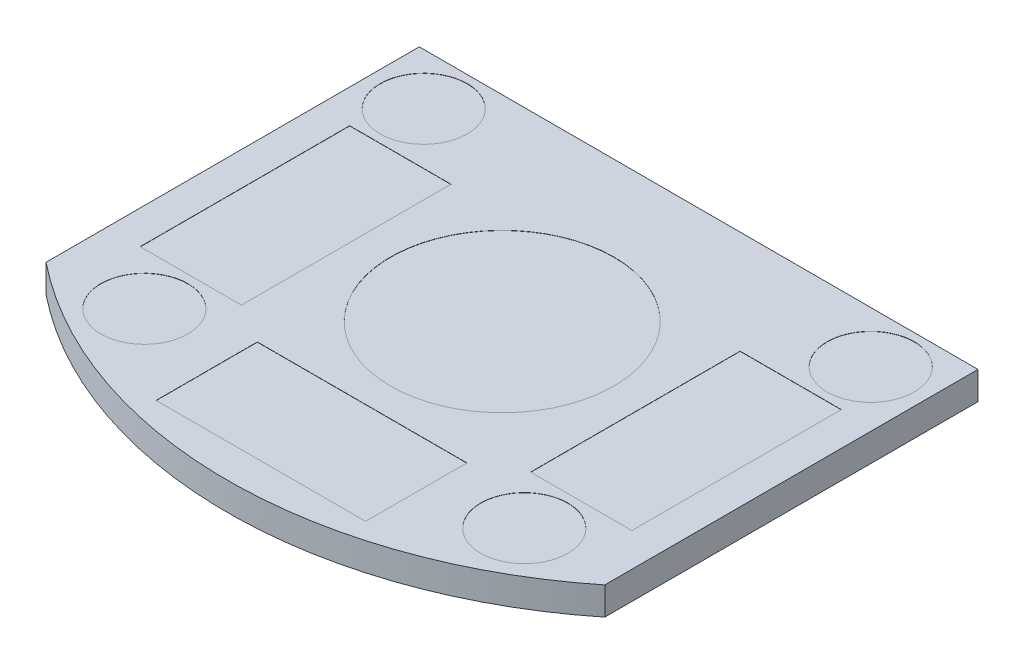
ISO-10303-21;
HEADER;
FILE_DESCRIPTION(('STEP AP214'),'2;1');
FILE_NAME('part.step','',(''),(''),'','','');
FILE_SCHEMA(('AUTOMOTIVE_DESIGN { 1 0 10303 214 1 1 1 1 }'));
ENDSEC;
DATA;
#1=APPLICATION_CONTEXT('core data for automotive mechanical design processes');
#2=APPLICATION_PROTOCOL_DEFINITION('international standard','automotive_design',2000,#1);
#3=PRODUCT_CONTEXT('',#1,'mechanical');
#4=PRODUCT('Part','Part','',(#3));
#5=PRODUCT_RELATED_PRODUCT_CATEGORY('part','',(#4));
#6=PRODUCT_DEFINITION_FORMATION('','',#4);
#7=PRODUCT_DEFINITION_CONTEXT('part definition',#1,'design');
#8=PRODUCT_DEFINITION('design','',#6,#7);
#9=PRODUCT_DEFINITION_SHAPE('','',#8);
#10=(LENGTH_UNIT() NAMED_UNIT(*) SI_UNIT(.MILLI.,.METRE.));
#11=(NAMED_UNIT(*) PLANE_ANGLE_UNIT() SI_UNIT($,.RADIAN.));
#12=(NAMED_UNIT(*) SI_UNIT($,.STERADIAN.) SOLID_ANGLE_UNIT());
#13=UNCERTAINTY_MEASURE_WITH_UNIT(LENGTH_MEASURE(1.E-05),#10,'distance_accuracy_value','');
#14=(GEOMETRIC_REPRESENTATION_CONTEXT(3) GLOBAL_UNCERTAINTY_ASSIGNED_CONTEXT((#13)) GLOBAL_UNIT_ASSIGNED_CONTEXT((#10,
#11,#12)) REPRESENTATION_CONTEXT('',''));
#15=CARTESIAN_POINT('',(0.,0.,0.));
#16=DIRECTION('',(0.,0.,1.));
#17=DIRECTION('',(1.,0.,0.));
#18=AXIS2_PLACEMENT_3D('',#15,#16,#17);
#19=CARTESIAN_POINT('',(-31.75,12.7,0.));
#20=DIRECTION('',(1.,0.,0.));
#21=DIRECTION('',(0.,0.,-1.));
#22=AXIS2_PLACEMENT_3D('',#19,#20,#21);
#23=PLANE('',#22);
#24=DIRECTION('',(0.,0.,1.));
#25=VECTOR('',#24,1.);
#26=CARTESIAN_POINT('',(-31.75,0.,0.));
#27=LINE('',#26,#25);
#28=CARTESIAN_POINT('',(-31.75,0.,0.));
#29=VERTEX_POINT('',#28);
#30=CARTESIAN_POINT('',(-31.75,0.,42.418));
#31=VERTEX_POINT('',#30);
#32=EDGE_CURVE('E163',#29,#31,#27,.T.);
#33=ORIENTED_EDGE('',*,*,#32,.F.);
#34=DIRECTION('',(0.,1.,0.));
#35=VECTOR('',#34,1.);
#36=CARTESIAN_POINT('',(-31.75,-3.175,0.));
#37=LINE('',#36,#35);
#38=CARTESIAN_POINT('',(-31.75,-3.175,0.));
#39=VERTEX_POINT('',#38);
#40=EDGE_CURVE('E53',#39,#29,#37,.T.);
#41=ORIENTED_EDGE('',*,*,#40,.F.);
#42=DIRECTION('',(0.,0.,-1.));
#43=VECTOR('',#42,1.);
#44=CARTESIAN_POINT('',(-31.75,-3.175,42.418));
#45=LINE('',#44,#43);
#46=CARTESIAN_POINT('',(-31.75,-3.175,42.418));
#47=VERTEX_POINT('',#46);
#48=EDGE_CURVE('E161',#47,#39,#45,.T.);
#49=ORIENTED_EDGE('',*,*,#48,.F.);
#50=DIRECTION('',(0.,-1.,0.));
#51=VECTOR('',#50,1.);
#52=CARTESIAN_POINT('',(-31.75,12.7,42.418));
#53=LINE('',#52,#51);
#54=EDGE_CURVE('E11',#31,#47,#53,.T.);
#55=ORIENTED_EDGE('',*,*,#54,.F.);
#56=EDGE_LOOP('',(#33,#41,#49,#55));
#57=FACE_BOUND('',#56,.T.);
#58=ADVANCED_FACE('F39',(#57),#23,.F.);
#59=CARTESIAN_POINT('',(0.,12.7,2.76226271017016));
#60=DIRECTION('',(0.,-1.,0.));
#61=DIRECTION('',(0.,0.,-1.));
#62=AXIS2_PLACEMENT_3D('',#59,#60,#61);
#63=CYLINDRICAL_SURFACE('',#62,50.8);
#64=CARTESIAN_POINT('',(0.,0.,2.76226271017016));
#65=DIRECTION('',(0.,1.,0.));
#66=DIRECTION('',(0.,0.,1.));
#67=AXIS2_PLACEMENT_3D('',#64,#65,#66);
#68=CIRCLE('',#67,50.8);
#69=CARTESIAN_POINT('',(31.75,0.,42.418));
#70=VERTEX_POINT('',#69);
#71=EDGE_CURVE('E183',#31,#70,#68,.T.);
#72=ORIENTED_EDGE('',*,*,#71,.F.);
#73=ORIENTED_EDGE('',*,*,#54,.T.);
#74=CARTESIAN_POINT('',(0.,-3.175,2.76226271017016));
#75=DIRECTION('',(0.,-1.,0.));
#76=DIRECTION('',(0.,0.,-1.));
#77=AXIS2_PLACEMENT_3D('',#74,#75,#76);
#78=CIRCLE('',#77,50.8);
#79=CARTESIAN_POINT('',(31.75,-3.175,42.418));
#80=VERTEX_POINT('',#79);
#81=EDGE_CURVE('E167',#80,#47,#78,.T.);
#82=ORIENTED_EDGE('',*,*,#81,.F.);
#83=DIRECTION('',(0.,-1.,0.));
#84=VECTOR('',#83,1.);
#85=CARTESIAN_POINT('',(31.75,12.7,42.418));
#86=LINE('',#85,#84);
#87=EDGE_CURVE('E46',#70,#80,#86,.T.);
#88=ORIENTED_EDGE('',*,*,#87,.F.);
#89=EDGE_LOOP('',(#72,#73,#82,#88));
#90=FACE_BOUND('',#89,.T.);
#91=ADVANCED_FACE('F182',(#90),#63,.T.);
#92=CARTESIAN_POINT('',(31.75,12.7,0.));
#93=DIRECTION('',(-1.,0.,0.));
#94=DIRECTION('',(0.,0.,1.));
#95=AXIS2_PLACEMENT_3D('',#92,#93,#94);
#96=PLANE('',#95);
#97=DIRECTION('',(0.,0.,1.));
#98=VECTOR('',#97,1.);
#99=CARTESIAN_POINT('',(31.75,-3.175,0.));
#100=LINE('',#99,#98);
#101=CARTESIAN_POINT('',(31.75,-3.175,0.));
#102=VERTEX_POINT('',#101);
#103=EDGE_CURVE('E168',#102,#80,#100,.T.);
#104=ORIENTED_EDGE('',*,*,#103,.F.);
#105=DIRECTION('',(0.,1.,0.));
#106=VECTOR('',#105,1.);
#107=CARTESIAN_POINT('',(31.75,-3.175,0.));
#108=LINE('',#107,#106);
#109=CARTESIAN_POINT('',(31.75,0.,0.));
#110=VERTEX_POINT('',#109);
#111=EDGE_CURVE('E151',#102,#110,#108,.T.);
#112=ORIENTED_EDGE('',*,*,#111,.T.);
#113=DIRECTION('',(0.,0.,-1.));
#114=VECTOR('',#113,1.);
#115=CARTESIAN_POINT('',(31.75,0.,0.));
#116=LINE('',#115,#114);
#117=EDGE_CURVE('E179',#70,#110,#116,.T.);
#118=ORIENTED_EDGE('',*,*,#117,.F.);
#119=ORIENTED_EDGE('',*,*,#87,.T.);
#120=EDGE_LOOP('',(#104,#112,#118,#119));
#121=FACE_BOUND('',#120,.T.);
#122=ADVANCED_FACE('F177',(#121),#96,.F.);
#123=CARTESIAN_POINT('',(0.,-3.175,2.76226271017016));
#124=DIRECTION('',(0.,-1.,0.));
#125=DIRECTION('',(0.,0.,-1.));
#126=AXIS2_PLACEMENT_3D('',#123,#124,#125);
#127=PLANE('',#126);
#128=DIRECTION('',(1.,0.,0.));
#129=VECTOR('',#128,1.);
#130=CARTESIAN_POINT('',(-31.75,-3.175,0.));
#131=LINE('',#130,#129);
#132=EDGE_CURVE('E148',#39,#102,#131,.T.);
#133=ORIENTED_EDGE('',*,*,#132,.T.);
#134=ORIENTED_EDGE('',*,*,#103,.T.);
#135=ORIENTED_EDGE('',*,*,#81,.T.);
#136=ORIENTED_EDGE('',*,*,#48,.T.);
#137=EDGE_LOOP('',(#133,#134,#135,#136));
#138=FACE_BOUND('',#137,.T.);
#139=ADVANCED_FACE('F165',(#138),#127,.T.);
#140=CARTESIAN_POINT('',(0.,0.,0.));
#141=DIRECTION('',(0.,1.,0.));
#142=DIRECTION('',(0.,0.,1.));
#143=AXIS2_PLACEMENT_3D('',#140,#141,#142);
#144=PLANE('',#143);
#145=DIRECTION('',(1.,0.,0.));
#146=VECTOR('',#145,1.);
#147=CARTESIAN_POINT('',(-31.75,0.,0.));
#148=LINE('',#147,#146);
#149=EDGE_CURVE('E155',#29,#110,#148,.T.);
#150=ORIENTED_EDGE('',*,*,#149,.F.);
#151=ORIENTED_EDGE('',*,*,#32,.T.);
#152=ORIENTED_EDGE('',*,*,#71,.T.);
#153=ORIENTED_EDGE('',*,*,#117,.T.);
#154=EDGE_LOOP('',(#150,#151,#152,#153));
#155=FACE_BOUND('',#154,.T.);
#156=DIRECTION('',(0.,0.,1.));
#157=VECTOR('',#156,1.);
#158=CARTESIAN_POINT('',(-27.94,0.,11.7157627101702));
#159=LINE('',#158,#157);
#160=CARTESIAN_POINT('',(-27.94,0.,11.7157627101702));
#161=VERTEX_POINT('',#160);
#162=CARTESIAN_POINT('',(-27.94,0.,35.5282627101702));
#163=VERTEX_POINT('',#162);
#164=EDGE_CURVE('E61',#161,#163,#159,.T.);
#165=ORIENTED_EDGE('',*,*,#164,.F.);
#166=DIRECTION('',(-1.,0.,0.));
#167=VECTOR('',#166,1.);
#168=CARTESIAN_POINT('',(-27.94,0.,11.7157627101702));
#169=LINE('',#168,#167);
#170=CARTESIAN_POINT('',(-16.430625,0.,11.7157627101702));
#171=VERTEX_POINT('',#170);
#172=EDGE_CURVE('E291',#171,#161,#169,.T.);
#173=ORIENTED_EDGE('',*,*,#172,.F.);
#174=DIRECTION('',(0.,0.,-1.));
#175=VECTOR('',#174,1.);
#176=CARTESIAN_POINT('',(-16.430625,0.,11.7157627101702));
#177=LINE('',#176,#175);
#178=CARTESIAN_POINT('',(-16.430625,0.,35.5282627101702));
#179=VERTEX_POINT('',#178);
#180=EDGE_CURVE('E295',#179,#171,#177,.T.);
#181=ORIENTED_EDGE('',*,*,#180,.F.);
#182=DIRECTION('',(1.,0.,0.));
#183=VECTOR('',#182,1.);
#184=CARTESIAN_POINT('',(-27.94,0.,35.5282627101702));
#185=LINE('',#184,#183);
#186=EDGE_CURVE('E298',#163,#179,#185,.T.);
#187=ORIENTED_EDGE('',*,*,#186,.F.);
#188=EDGE_LOOP('',(#165,#173,#181,#187));
#189=FACE_BOUND('',#188,.T.);
#190=DIRECTION('',(0.,0.,1.));
#191=VECTOR('',#190,1.);
#192=CARTESIAN_POINT('',(-11.90625,0.,38.2428877101702));
#193=LINE('',#192,#191);
#194=CARTESIAN_POINT('',(-11.90625,0.,38.2428877101702));
#195=VERTEX_POINT('',#194);
#196=CARTESIAN_POINT('',(-11.90625,0.,49.7522627101702));
#197=VERTEX_POINT('',#196);
#198=EDGE_CURVE('E266',#195,#197,#193,.T.);
#199=ORIENTED_EDGE('',*,*,#198,.F.);
#200=DIRECTION('',(-1.,0.,0.));
#201=VECTOR('',#200,1.);
#202=CARTESIAN_POINT('',(11.90625,0.,38.2428877101702));
#203=LINE('',#202,#201);
#204=CARTESIAN_POINT('',(11.90625,0.,38.2428877101702));
#205=VERTEX_POINT('',#204);
#206=EDGE_CURVE('E255',#205,#195,#203,.T.);
#207=ORIENTED_EDGE('',*,*,#206,.F.);
#208=DIRECTION('',(0.,0.,-1.));
#209=VECTOR('',#208,1.);
#210=CARTESIAN_POINT('',(11.90625,0.,38.2428877101702));
#211=LINE('',#210,#209);
#212=CARTESIAN_POINT('',(11.90625,0.,49.7522627101702));
#213=VERTEX_POINT('',#212);
#214=EDGE_CURVE('E271',#213,#205,#211,.T.);
#215=ORIENTED_EDGE('',*,*,#214,.F.);
#216=DIRECTION('',(1.,0.,0.));
#217=VECTOR('',#216,1.);
#218=CARTESIAN_POINT('',(11.90625,0.,49.7522627101702));
#219=LINE('',#218,#217);
#220=EDGE_CURVE('E268',#197,#213,#219,.T.);
#221=ORIENTED_EDGE('',*,*,#220,.F.);
#222=EDGE_LOOP('',(#199,#207,#215,#221));
#223=FACE_BOUND('',#222,.T.);
#224=DIRECTION('',(-1.,0.,0.));
#225=VECTOR('',#224,1.);
#226=CARTESIAN_POINT('',(27.94,0.,11.7157627101702));
#227=LINE('',#226,#225);
#228=CARTESIAN_POINT('',(27.94,0.,11.7157627101702));
#229=VERTEX_POINT('',#228);
#230=CARTESIAN_POINT('',(16.430625,0.,11.7157627101702));
#231=VERTEX_POINT('',#230);
#232=EDGE_CURVE('E233',#229,#231,#227,.T.);
#233=ORIENTED_EDGE('',*,*,#232,.F.);
#234=DIRECTION('',(0.,0.,-1.));
#235=VECTOR('',#234,1.);
#236=CARTESIAN_POINT('',(27.94,0.,11.7157627101702));
#237=LINE('',#236,#235);
#238=CARTESIAN_POINT('',(27.94,0.,35.5282627101702));
#239=VERTEX_POINT('',#238);
#240=EDGE_CURVE('E222',#239,#229,#237,.T.);
#241=ORIENTED_EDGE('',*,*,#240,.F.);
#242=DIRECTION('',(1.,0.,0.));
#243=VECTOR('',#242,1.);
#244=CARTESIAN_POINT('',(27.94,0.,35.5282627101702));
#245=LINE('',#244,#243);
#246=CARTESIAN_POINT('',(16.430625,0.,35.5282627101702));
#247=VERTEX_POINT('',#246);
#248=EDGE_CURVE('E239',#247,#239,#245,.T.);
#249=ORIENTED_EDGE('',*,*,#248,.F.);
#250=DIRECTION('',(0.,0.,1.));
#251=VECTOR('',#250,1.);
#252=CARTESIAN_POINT('',(16.430625,0.,11.7157627101702));
#253=LINE('',#252,#251);
#254=EDGE_CURVE('E236',#231,#247,#253,.T.);
#255=ORIENTED_EDGE('',*,*,#254,.F.);
#256=EDGE_LOOP('',(#233,#241,#249,#255));
#257=FACE_BOUND('',#256,.T.);
#258=CARTESIAN_POINT('',(-21.59,0.,41.402));
#259=DIRECTION('',(0.,1.,0.));
#260=DIRECTION('',(0.,0.,-1.));
#261=AXIS2_PLACEMENT_3D('',#258,#259,#260);
#262=CIRCLE('',#261,4.95299999999999);
#263=CARTESIAN_POINT('',(-21.59,0.,36.449));
#264=VERTEX_POINT('',#263);
#265=EDGE_CURVE('E198',#264,#264,#262,.T.);
#266=ORIENTED_EDGE('',*,*,#265,.F.);
#267=EDGE_LOOP('',(#266));
#268=FACE_BOUND('',#267,.T.);
#269=CARTESIAN_POINT('',(-25.4,0.,5.84199999999998));
#270=DIRECTION('',(0.,1.,0.));
#271=DIRECTION('',(0.,0.,-1.));
#272=AXIS2_PLACEMENT_3D('',#269,#270,#271);
#273=CIRCLE('',#272,4.953);
#274=CARTESIAN_POINT('',(-25.4,0.,0.888999999999982));
#275=VERTEX_POINT('',#274);
#276=EDGE_CURVE('E205',#275,#275,#273,.T.);
#277=ORIENTED_EDGE('',*,*,#276,.F.);
#278=EDGE_LOOP('',(#277));
#279=FACE_BOUND('',#278,.T.);
#280=CARTESIAN_POINT('',(21.59,0.,41.402));
#281=DIRECTION('',(0.,1.,0.));
#282=DIRECTION('',(0.,0.,1.));
#283=AXIS2_PLACEMENT_3D('',#280,#281,#282);
#284=CIRCLE('',#283,4.95299999999999);
#285=CARTESIAN_POINT('',(21.59,0.,46.355));
#286=VERTEX_POINT('',#285);
#287=EDGE_CURVE('E211',#286,#286,#284,.T.);
#288=ORIENTED_EDGE('',*,*,#287,.F.);
#289=EDGE_LOOP('',(#288));
#290=FACE_BOUND('',#289,.T.);
#291=CARTESIAN_POINT('',(25.4,0.,5.84199999999997));
#292=DIRECTION('',(0.,1.,0.));
#293=DIRECTION('',(0.,0.,1.));
#294=AXIS2_PLACEMENT_3D('',#291,#292,#293);
#295=CIRCLE('',#294,4.953);
#296=CARTESIAN_POINT('',(25.4,0.,10.795));
#297=VERTEX_POINT('',#296);
#298=EDGE_CURVE('E192',#297,#297,#295,.T.);
#299=ORIENTED_EDGE('',*,*,#298,.F.);
#300=EDGE_LOOP('',(#299));
#301=FACE_BOUND('',#300,.T.);
#302=CARTESIAN_POINT('',(0.,0.,22.3202627101702));
#303=DIRECTION('',(0.,1.,0.));
#304=DIRECTION('',(0.,0.,1.));
#305=AXIS2_PLACEMENT_3D('',#302,#303,#304);
#306=CIRCLE('',#305,12.7);
#307=CARTESIAN_POINT('',(0.,0.,35.0202627101702));
#308=VERTEX_POINT('',#307);
#309=EDGE_CURVE('E189',#308,#308,#306,.T.);
#310=ORIENTED_EDGE('',*,*,#309,.F.);
#311=EDGE_LOOP('',(#310));
#312=FACE_BOUND('',#311,.T.);
#313=ADVANCED_FACE('F313',(#155,#189,#223,#257,#268,#279,#290,#301,#312),#144,.T.);
#314=CARTESIAN_POINT('',(0.,-0.0254,22.3202627101702));
#315=DIRECTION('',(0.,1.,0.));
#316=DIRECTION('',(0.,0.,1.));
#317=AXIS2_PLACEMENT_3D('',#314,#315,#316);
#318=CYLINDRICAL_SURFACE('',#317,12.7);
#319=CARTESIAN_POINT('',(0.,-0.0254,22.3202627101702));
#320=DIRECTION('',(0.,1.,0.));
#321=DIRECTION('',(0.,0.,1.));
#322=AXIS2_PLACEMENT_3D('',#319,#320,#321);
#323=CIRCLE('',#322,12.7);
#324=CARTESIAN_POINT('',(0.,-0.0254,35.0202627101702));
#325=VERTEX_POINT('',#324);
#326=EDGE_CURVE('E186',#325,#325,#323,.T.);
#327=ORIENTED_EDGE('',*,*,#326,.F.);
#328=EDGE_LOOP('',(#327));
#329=FACE_BOUND('',#328,.T.);
#330=ORIENTED_EDGE('',*,*,#309,.T.);
#331=EDGE_LOOP('',(#330));
#332=FACE_BOUND('',#331,.T.);
#333=ADVANCED_FACE('F316',(#329,#332),#318,.F.);
#334=CARTESIAN_POINT('',(0.,-0.0254,22.3202627101702));
#335=DIRECTION('',(0.,1.,0.));
#336=DIRECTION('',(0.,0.,1.));
#337=AXIS2_PLACEMENT_3D('',#334,#335,#336);
#338=PLANE('',#337);
#339=ORIENTED_EDGE('',*,*,#326,.T.);
#340=EDGE_LOOP('',(#339));
#341=FACE_BOUND('',#340,.T.);
#342=ADVANCED_FACE('F340',(#341),#338,.T.);
#343=CARTESIAN_POINT('',(25.4,-0.0254,5.84199999999997));
#344=DIRECTION('',(0.,1.,0.));
#345=DIRECTION('',(0.,0.,1.));
#346=AXIS2_PLACEMENT_3D('',#343,#344,#345);
#347=CYLINDRICAL_SURFACE('',#346,4.953);
#348=CARTESIAN_POINT('',(25.4,-0.0254,5.84199999999997));
#349=DIRECTION('',(0.,1.,0.));
#350=DIRECTION('',(0.,0.,1.));
#351=AXIS2_PLACEMENT_3D('',#348,#349,#350);
#352=CIRCLE('',#351,4.953);
#353=CARTESIAN_POINT('',(25.4,-0.0254,10.795));
#354=VERTEX_POINT('',#353);
#355=EDGE_CURVE('E214',#354,#354,#352,.T.);
#356=ORIENTED_EDGE('',*,*,#355,.F.);
#357=EDGE_LOOP('',(#356));
#358=FACE_BOUND('',#357,.T.);
#359=ORIENTED_EDGE('',*,*,#298,.T.);
#360=EDGE_LOOP('',(#359));
#361=FACE_BOUND('',#360,.T.);
#362=ADVANCED_FACE('F347',(#358,#361),#347,.F.);
#363=CARTESIAN_POINT('',(25.4,-0.0254,5.84199999999997));
#364=DIRECTION('',(0.,1.,0.));
#365=DIRECTION('',(0.,0.,1.));
#366=AXIS2_PLACEMENT_3D('',#363,#364,#365);
#367=PLANE('',#366);
#368=ORIENTED_EDGE('',*,*,#355,.T.);
#369=EDGE_LOOP('',(#368));
#370=FACE_BOUND('',#369,.T.);
#371=ADVANCED_FACE('F586',(#370),#367,.T.);
#372=CARTESIAN_POINT('',(21.59,-0.0254,41.402));
#373=DIRECTION('',(0.,1.,0.));
#374=DIRECTION('',(0.,0.,1.));
#375=AXIS2_PLACEMENT_3D('',#372,#373,#374);
#376=CYLINDRICAL_SURFACE('',#375,4.95299999999999);
#377=CARTESIAN_POINT('',(21.59,-0.0254,41.402));
#378=DIRECTION('',(0.,1.,0.));
#379=DIRECTION('',(0.,0.,1.));
#380=AXIS2_PLACEMENT_3D('',#377,#378,#379);
#381=CIRCLE('',#380,4.95299999999999);
#382=CARTESIAN_POINT('',(21.59,-0.0254,46.355));
#383=VERTEX_POINT('',#382);
#384=EDGE_CURVE('E208',#383,#383,#381,.T.);
#385=ORIENTED_EDGE('',*,*,#384,.F.);
#386=EDGE_LOOP('',(#385));
#387=FACE_BOUND('',#386,.T.);
#388=ORIENTED_EDGE('',*,*,#287,.T.);
#389=EDGE_LOOP('',(#388));
#390=FACE_BOUND('',#389,.T.);
#391=ADVANCED_FACE('F576',(#387,#390),#376,.F.);
#392=CARTESIAN_POINT('',(21.59,-0.0254,41.402));
#393=DIRECTION('',(0.,1.,0.));
#394=DIRECTION('',(0.,0.,1.));
#395=AXIS2_PLACEMENT_3D('',#392,#393,#394);
#396=PLANE('',#395);
#397=ORIENTED_EDGE('',*,*,#384,.T.);
#398=EDGE_LOOP('',(#397));
#399=FACE_BOUND('',#398,.T.);
#400=ADVANCED_FACE('F566',(#399),#396,.T.);
#401=CARTESIAN_POINT('',(-25.4,-0.0254,5.84199999999998));
#402=DIRECTION('',(0.,1.,0.));
#403=DIRECTION('',(0.,0.,1.));
#404=AXIS2_PLACEMENT_3D('',#401,#402,#403);
#405=CYLINDRICAL_SURFACE('',#404,4.953);
#406=CARTESIAN_POINT('',(-25.4,-0.0254,5.84199999999998));
#407=DIRECTION('',(0.,1.,0.));
#408=DIRECTION('',(0.,0.,-1.));
#409=AXIS2_PLACEMENT_3D('',#406,#407,#408);
#410=CIRCLE('',#409,4.953);
#411=CARTESIAN_POINT('',(-25.4,-0.0254,0.888999999999982));
#412=VERTEX_POINT('',#411);
#413=EDGE_CURVE('E202',#412,#412,#410,.T.);
#414=ORIENTED_EDGE('',*,*,#413,.F.);
#415=EDGE_LOOP('',(#414));
#416=FACE_BOUND('',#415,.T.);
#417=ORIENTED_EDGE('',*,*,#276,.T.);
#418=EDGE_LOOP('',(#417));
#419=FACE_BOUND('',#418,.T.);
#420=ADVANCED_FACE('F556',(#416,#419),#405,.F.);
#421=CARTESIAN_POINT('',(-25.4,-0.0254,5.84199999999998));
#422=DIRECTION('',(0.,-1.,0.));
#423=DIRECTION('',(0.,0.,-1.));
#424=AXIS2_PLACEMENT_3D('',#421,#422,#423);
#425=PLANE('',#424);
#426=ORIENTED_EDGE('',*,*,#413,.T.);
#427=EDGE_LOOP('',(#426));
#428=FACE_BOUND('',#427,.T.);
#429=ADVANCED_FACE('F546',(#428),#425,.F.);
#430=CARTESIAN_POINT('',(-21.59,-0.0254,41.402));
#431=DIRECTION('',(0.,1.,0.));
#432=DIRECTION('',(0.,0.,1.));
#433=AXIS2_PLACEMENT_3D('',#430,#431,#432);
#434=CYLINDRICAL_SURFACE('',#433,4.95299999999999);
#435=CARTESIAN_POINT('',(-21.59,-0.0254,41.402));
#436=DIRECTION('',(0.,1.,0.));
#437=DIRECTION('',(0.,0.,-1.));
#438=AXIS2_PLACEMENT_3D('',#435,#436,#437);
#439=CIRCLE('',#438,4.95299999999999);
#440=CARTESIAN_POINT('',(-21.59,-0.0254,36.449));
#441=VERTEX_POINT('',#440);
#442=EDGE_CURVE('E195',#441,#441,#439,.T.);
#443=ORIENTED_EDGE('',*,*,#442,.F.);
#444=EDGE_LOOP('',(#443));
#445=FACE_BOUND('',#444,.T.);
#446=ORIENTED_EDGE('',*,*,#265,.T.);
#447=EDGE_LOOP('',(#446));
#448=FACE_BOUND('',#447,.T.);
#449=ADVANCED_FACE('F536',(#445,#448),#434,.F.);
#450=CARTESIAN_POINT('',(-21.59,-0.0254,41.402));
#451=DIRECTION('',(0.,-1.,0.));
#452=DIRECTION('',(0.,0.,-1.));
#453=AXIS2_PLACEMENT_3D('',#450,#451,#452);
#454=PLANE('',#453);
#455=ORIENTED_EDGE('',*,*,#442,.T.);
#456=EDGE_LOOP('',(#455));
#457=FACE_BOUND('',#456,.T.);
#458=ADVANCED_FACE('F526',(#457),#454,.F.);
#459=CARTESIAN_POINT('',(27.94,-0.0254,11.7157627101702));
#460=DIRECTION('',(0.,0.,-1.));
#461=DIRECTION('',(-1.,0.,0.));
#462=AXIS2_PLACEMENT_3D('',#459,#460,#461);
#463=PLANE('',#462);
#464=ORIENTED_EDGE('',*,*,#232,.T.);
#465=DIRECTION('',(0.,1.,0.));
#466=VECTOR('',#465,1.);
#467=CARTESIAN_POINT('',(16.430625,-0.0254,11.7157627101702));
#468=LINE('',#467,#466);
#469=CARTESIAN_POINT('',(16.430625,-0.0254,11.7157627101702));
#470=VERTEX_POINT('',#469);
#471=EDGE_CURVE('E232',#470,#231,#468,.T.);
#472=ORIENTED_EDGE('',*,*,#471,.F.);
#473=DIRECTION('',(-1.,0.,0.));
#474=VECTOR('',#473,1.);
#475=CARTESIAN_POINT('',(27.94,-0.0254,11.7157627101702));
#476=LINE('',#475,#474);
#477=CARTESIAN_POINT('',(27.94,-0.0254,11.7157627101702));
#478=VERTEX_POINT('',#477);
#479=EDGE_CURVE('E219',#478,#470,#476,.T.);
#480=ORIENTED_EDGE('',*,*,#479,.F.);
#481=DIRECTION('',(0.,1.,0.));
#482=VECTOR('',#481,1.);
#483=CARTESIAN_POINT('',(27.94,-0.0254,11.7157627101702));
#484=LINE('',#483,#482);
#485=EDGE_CURVE('E244',#478,#229,#484,.T.);
#486=ORIENTED_EDGE('',*,*,#485,.T.);
#487=EDGE_LOOP('',(#464,#472,#480,#486));
#488=FACE_BOUND('',#487,.T.);
#489=ADVANCED_FACE('F516',(#488),#463,.F.);
#490=CARTESIAN_POINT('',(27.94,-0.0254,11.7157627101702));
#491=DIRECTION('',(1.,0.,0.));
#492=DIRECTION('',(0.,0.,-1.));
#493=AXIS2_PLACEMENT_3D('',#490,#491,#492);
#494=PLANE('',#493);
#495=ORIENTED_EDGE('',*,*,#240,.T.);
#496=ORIENTED_EDGE('',*,*,#485,.F.);
#497=DIRECTION('',(0.,0.,-1.));
#498=VECTOR('',#497,1.);
#499=CARTESIAN_POINT('',(27.94,-0.0254,11.7157627101702));
#500=LINE('',#499,#498);
#501=CARTESIAN_POINT('',(27.94,-0.0254,35.5282627101702));
#502=VERTEX_POINT('',#501);
#503=EDGE_CURVE('E229',#502,#478,#500,.T.);
#504=ORIENTED_EDGE('',*,*,#503,.F.);
#505=DIRECTION('',(0.,1.,0.));
#506=VECTOR('',#505,1.);
#507=CARTESIAN_POINT('',(27.94,-0.0254,35.5282627101702));
#508=LINE('',#507,#506);
#509=EDGE_CURVE('E246',#502,#239,#508,.T.);
#510=ORIENTED_EDGE('',*,*,#509,.T.);
#511=EDGE_LOOP('',(#495,#496,#504,#510));
#512=FACE_BOUND('',#511,.T.);
#513=ADVANCED_FACE('F506',(#512),#494,.F.);
#514=CARTESIAN_POINT('',(27.94,-0.0254,35.5282627101702));
#515=DIRECTION('',(0.,0.,1.));
#516=DIRECTION('',(1.,0.,0.));
#517=AXIS2_PLACEMENT_3D('',#514,#515,#516);
#518=PLANE('',#517);
#519=ORIENTED_EDGE('',*,*,#248,.T.);
#520=ORIENTED_EDGE('',*,*,#509,.F.);
#521=DIRECTION('',(1.,0.,0.));
#522=VECTOR('',#521,1.);
#523=CARTESIAN_POINT('',(27.94,-0.0254,35.5282627101702));
#524=LINE('',#523,#522);
#525=CARTESIAN_POINT('',(16.430625,-0.0254,35.5282627101702));
#526=VERTEX_POINT('',#525);
#527=EDGE_CURVE('E226',#526,#502,#524,.T.);
#528=ORIENTED_EDGE('',*,*,#527,.F.);
#529=DIRECTION('',(0.,1.,0.));
#530=VECTOR('',#529,1.);
#531=CARTESIAN_POINT('',(16.430625,-0.0254,35.5282627101702));
#532=LINE('',#531,#530);
#533=EDGE_CURVE('E248',#526,#247,#532,.T.);
#534=ORIENTED_EDGE('',*,*,#533,.T.);
#535=EDGE_LOOP('',(#519,#520,#528,#534));
#536=FACE_BOUND('',#535,.T.);
#537=ADVANCED_FACE('F496',(#536),#518,.F.);
#538=CARTESIAN_POINT('',(16.430625,-0.0254,11.7157627101702));
#539=DIRECTION('',(-1.,0.,0.));
#540=DIRECTION('',(0.,0.,1.));
#541=AXIS2_PLACEMENT_3D('',#538,#539,#540);
#542=PLANE('',#541);
#543=ORIENTED_EDGE('',*,*,#254,.T.);
#544=ORIENTED_EDGE('',*,*,#533,.F.);
#545=DIRECTION('',(0.,0.,1.));
#546=VECTOR('',#545,1.);
#547=CARTESIAN_POINT('',(16.430625,-0.0254,11.7157627101702));
#548=LINE('',#547,#546);
#549=EDGE_CURVE('E223',#470,#526,#548,.T.);
#550=ORIENTED_EDGE('',*,*,#549,.F.);
#551=ORIENTED_EDGE('',*,*,#471,.T.);
#552=EDGE_LOOP('',(#543,#544,#550,#551));
#553=FACE_BOUND('',#552,.T.);
#554=ADVANCED_FACE('F486',(#553),#542,.F.);
#555=CARTESIAN_POINT('',(0.,-0.0254,0.));
#556=DIRECTION('',(0.,1.,0.));
#557=DIRECTION('',(0.,0.,1.));
#558=AXIS2_PLACEMENT_3D('',#555,#556,#557);
#559=PLANE('',#558);
#560=ORIENTED_EDGE('',*,*,#479,.T.);
#561=ORIENTED_EDGE('',*,*,#549,.T.);
#562=ORIENTED_EDGE('',*,*,#527,.T.);
#563=ORIENTED_EDGE('',*,*,#503,.T.);
#564=EDGE_LOOP('',(#560,#561,#562,#563));
#565=FACE_BOUND('',#564,.T.);
#566=ADVANCED_FACE('F476',(#565),#559,.T.);
#567=CARTESIAN_POINT('',(-11.90625,-0.0254,38.2428877101702));
#568=DIRECTION('',(-1.,0.,0.));
#569=DIRECTION('',(0.,0.,1.));
#570=AXIS2_PLACEMENT_3D('',#567,#568,#569);
#571=PLANE('',#570);
#572=ORIENTED_EDGE('',*,*,#198,.T.);
#573=DIRECTION('',(0.,1.,0.));
#574=VECTOR('',#573,1.);
#575=CARTESIAN_POINT('',(-11.90625,-0.0254,49.7522627101702));
#576=LINE('',#575,#574);
#577=CARTESIAN_POINT('',(-11.90625,-0.0254,49.7522627101702));
#578=VERTEX_POINT('',#577);
#579=EDGE_CURVE('E265',#578,#197,#576,.T.);
#580=ORIENTED_EDGE('',*,*,#579,.F.);
#581=DIRECTION('',(0.,0.,1.));
#582=VECTOR('',#581,1.);
#583=CARTESIAN_POINT('',(-11.90625,-0.0254,38.2428877101702));
#584=LINE('',#583,#582);
#585=CARTESIAN_POINT('',(-11.90625,-0.0254,38.2428877101702));
#586=VERTEX_POINT('',#585);
#587=EDGE_CURVE('E252',#586,#578,#584,.T.);
#588=ORIENTED_EDGE('',*,*,#587,.F.);
#589=DIRECTION('',(0.,1.,0.));
#590=VECTOR('',#589,1.);
#591=CARTESIAN_POINT('',(-11.90625,-0.0254,38.2428877101702));
#592=LINE('',#591,#590);
#593=EDGE_CURVE('E235',#586,#195,#592,.T.);
#594=ORIENTED_EDGE('',*,*,#593,.T.);
#595=EDGE_LOOP('',(#572,#580,#588,#594));
#596=FACE_BOUND('',#595,.T.);
#597=ADVANCED_FACE('F466',(#596),#571,.F.);
#598=CARTESIAN_POINT('',(11.90625,-0.0254,38.2428877101702));
#599=DIRECTION('',(0.,0.,-1.));
#600=DIRECTION('',(-1.,0.,0.));
#601=AXIS2_PLACEMENT_3D('',#598,#599,#600);
#602=PLANE('',#601);
#603=ORIENTED_EDGE('',*,*,#206,.T.);
#604=ORIENTED_EDGE('',*,*,#593,.F.);
#605=DIRECTION('',(-1.,0.,0.));
#606=VECTOR('',#605,1.);
#607=CARTESIAN_POINT('',(11.90625,-0.0254,38.2428877101702));
#608=LINE('',#607,#606);
#609=CARTESIAN_POINT('',(11.90625,-0.0254,38.2428877101702));
#610=VERTEX_POINT('',#609);
#611=EDGE_CURVE('E262',#610,#586,#608,.T.);
#612=ORIENTED_EDGE('',*,*,#611,.F.);
#613=DIRECTION('',(0.,1.,0.));
#614=VECTOR('',#613,1.);
#615=CARTESIAN_POINT('',(11.90625,-0.0254,38.2428877101702));
#616=LINE('',#615,#614);
#617=EDGE_CURVE('E277',#610,#205,#616,.T.);
#618=ORIENTED_EDGE('',*,*,#617,.T.);
#619=EDGE_LOOP('',(#603,#604,#612,#618));
#620=FACE_BOUND('',#619,.T.);
#621=ADVANCED_FACE('F456',(#620),#602,.F.);
#622=CARTESIAN_POINT('',(11.90625,-0.0254,38.2428877101702));
#623=DIRECTION('',(1.,0.,0.));
#624=DIRECTION('',(0.,0.,-1.));
#625=AXIS2_PLACEMENT_3D('',#622,#623,#624);
#626=PLANE('',#625);
#627=ORIENTED_EDGE('',*,*,#214,.T.);
#628=ORIENTED_EDGE('',*,*,#617,.F.);
#629=DIRECTION('',(0.,0.,-1.));
#630=VECTOR('',#629,1.);
#631=CARTESIAN_POINT('',(11.90625,-0.0254,38.2428877101702));
#632=LINE('',#631,#630);
#633=CARTESIAN_POINT('',(11.90625,-0.0254,49.7522627101702));
#634=VERTEX_POINT('',#633);
#635=EDGE_CURVE('E259',#634,#610,#632,.T.);
#636=ORIENTED_EDGE('',*,*,#635,.F.);
#637=DIRECTION('',(0.,1.,0.));
#638=VECTOR('',#637,1.);
#639=CARTESIAN_POINT('',(11.90625,-0.0254,49.7522627101702));
#640=LINE('',#639,#638);
#641=EDGE_CURVE('E279',#634,#213,#640,.T.);
#642=ORIENTED_EDGE('',*,*,#641,.T.);
#643=EDGE_LOOP('',(#627,#628,#636,#642));
#644=FACE_BOUND('',#643,.T.);
#645=ADVANCED_FACE('F446',(#644),#626,.F.);
#646=CARTESIAN_POINT('',(11.90625,-0.0254,49.7522627101702));
#647=DIRECTION('',(0.,0.,1.));
#648=DIRECTION('',(1.,0.,0.));
#649=AXIS2_PLACEMENT_3D('',#646,#647,#648);
#650=PLANE('',#649);
#651=ORIENTED_EDGE('',*,*,#220,.T.);
#652=ORIENTED_EDGE('',*,*,#641,.F.);
#653=DIRECTION('',(1.,0.,0.));
#654=VECTOR('',#653,1.);
#655=CARTESIAN_POINT('',(11.90625,-0.0254,49.7522627101702));
#656=LINE('',#655,#654);
#657=EDGE_CURVE('E256',#578,#634,#656,.T.);
#658=ORIENTED_EDGE('',*,*,#657,.F.);
#659=ORIENTED_EDGE('',*,*,#579,.T.);
#660=EDGE_LOOP('',(#651,#652,#658,#659));
#661=FACE_BOUND('',#660,.T.);
#662=ADVANCED_FACE('F436',(#661),#650,.F.);
#663=CARTESIAN_POINT('',(0.,-0.0254,0.));
#664=DIRECTION('',(0.,-1.,0.));
#665=DIRECTION('',(0.,0.,-1.));
#666=AXIS2_PLACEMENT_3D('',#663,#664,#665);
#667=PLANE('',#666);
#668=ORIENTED_EDGE('',*,*,#587,.T.);
#669=ORIENTED_EDGE('',*,*,#657,.T.);
#670=ORIENTED_EDGE('',*,*,#635,.T.);
#671=ORIENTED_EDGE('',*,*,#611,.T.);
#672=EDGE_LOOP('',(#668,#669,#670,#671));
#673=FACE_BOUND('',#672,.T.);
#674=ADVANCED_FACE('F427',(#673),#667,.F.);
#675=CARTESIAN_POINT('',(-27.94,-0.0254,11.7157627101702));
#676=DIRECTION('',(-1.,0.,0.));
#677=DIRECTION('',(0.,0.,1.));
#678=AXIS2_PLACEMENT_3D('',#675,#676,#677);
#679=PLANE('',#678);
#680=ORIENTED_EDGE('',*,*,#164,.T.);
#681=DIRECTION('',(0.,1.,0.));
#682=VECTOR('',#681,1.);
#683=CARTESIAN_POINT('',(-27.94,-0.0254,35.5282627101702));
#684=LINE('',#683,#682);
#685=CARTESIAN_POINT('',(-27.94,-0.0254,35.5282627101702));
#686=VERTEX_POINT('',#685);
#687=EDGE_CURVE('E283',#686,#163,#684,.T.);
#688=ORIENTED_EDGE('',*,*,#687,.F.);
#689=DIRECTION('',(0.,0.,1.));
#690=VECTOR('',#689,1.);
#691=CARTESIAN_POINT('',(-27.94,-0.0254,11.7157627101702));
#692=LINE('',#691,#690);
#693=CARTESIAN_POINT('',(-27.94,-0.0254,11.7157627101702));
#694=VERTEX_POINT('',#693);
#695=EDGE_CURVE('E294',#694,#686,#692,.T.);
#696=ORIENTED_EDGE('',*,*,#695,.F.);
#697=DIRECTION('',(0.,1.,0.));
#698=VECTOR('',#697,1.);
#699=CARTESIAN_POINT('',(-27.94,-0.0254,11.7157627101702));
#700=LINE('',#699,#698);
#701=EDGE_CURVE('E199',#694,#161,#700,.T.);
#702=ORIENTED_EDGE('',*,*,#701,.T.);
#703=EDGE_LOOP('',(#680,#688,#696,#702));
#704=FACE_BOUND('',#703,.T.);
#705=ADVANCED_FACE('F417',(#704),#679,.F.);
#706=CARTESIAN_POINT('',(-27.94,-0.0254,11.7157627101702));
#707=DIRECTION('',(0.,0.,-1.));
#708=DIRECTION('',(-1.,0.,0.));
#709=AXIS2_PLACEMENT_3D('',#706,#707,#708);
#710=PLANE('',#709);
#711=ORIENTED_EDGE('',*,*,#172,.T.);
#712=ORIENTED_EDGE('',*,*,#701,.F.);
#713=DIRECTION('',(-1.,0.,0.));
#714=VECTOR('',#713,1.);
#715=CARTESIAN_POINT('',(-27.94,-0.0254,11.7157627101702));
#716=LINE('',#715,#714);
#717=CARTESIAN_POINT('',(-16.430625,-0.0254,11.7157627101702));
#718=VERTEX_POINT('',#717);
#719=EDGE_CURVE('E286',#718,#694,#716,.T.);
#720=ORIENTED_EDGE('',*,*,#719,.F.);
#721=DIRECTION('',(0.,1.,0.));
#722=VECTOR('',#721,1.);
#723=CARTESIAN_POINT('',(-16.430625,-0.0254,11.7157627101702));
#724=LINE('',#723,#722);
#725=EDGE_CURVE('E288',#718,#171,#724,.T.);
#726=ORIENTED_EDGE('',*,*,#725,.T.);
#727=EDGE_LOOP('',(#711,#712,#720,#726));
#728=FACE_BOUND('',#727,.T.);
#729=ADVANCED_FACE('F407',(#728),#710,.F.);
#730=CARTESIAN_POINT('',(-16.430625,-0.0254,11.7157627101702));
#731=DIRECTION('',(1.,0.,0.));
#732=DIRECTION('',(0.,0.,-1.));
#733=AXIS2_PLACEMENT_3D('',#730,#731,#732);
#734=PLANE('',#733);
#735=ORIENTED_EDGE('',*,*,#180,.T.);
#736=ORIENTED_EDGE('',*,*,#725,.F.);
#737=DIRECTION('',(0.,0.,-1.));
#738=VECTOR('',#737,1.);
#739=CARTESIAN_POINT('',(-16.430625,-0.0254,11.7157627101702));
#740=LINE('',#739,#738);
#741=CARTESIAN_POINT('',(-16.430625,-0.0254,35.5282627101702));
#742=VERTEX_POINT('',#741);
#743=EDGE_CURVE('E304',#742,#718,#740,.T.);
#744=ORIENTED_EDGE('',*,*,#743,.F.);
#745=DIRECTION('',(0.,1.,0.));
#746=VECTOR('',#745,1.);
#747=CARTESIAN_POINT('',(-16.430625,-0.0254,35.5282627101702));
#748=LINE('',#747,#746);
#749=EDGE_CURVE('E285',#742,#179,#748,.T.);
#750=ORIENTED_EDGE('',*,*,#749,.T.);
#751=EDGE_LOOP('',(#735,#736,#744,#750));
#752=FACE_BOUND('',#751,.T.);
#753=ADVANCED_FACE('F397',(#752),#734,.F.);
#754=CARTESIAN_POINT('',(-27.94,-0.0254,35.5282627101702));
#755=DIRECTION('',(0.,0.,1.));
#756=DIRECTION('',(1.,0.,0.));
#757=AXIS2_PLACEMENT_3D('',#754,#755,#756);
#758=PLANE('',#757);
#759=ORIENTED_EDGE('',*,*,#186,.T.);
#760=ORIENTED_EDGE('',*,*,#749,.F.);
#761=DIRECTION('',(1.,0.,0.));
#762=VECTOR('',#761,1.);
#763=CARTESIAN_POINT('',(-27.94,-0.0254,35.5282627101702));
#764=LINE('',#763,#762);
#765=EDGE_CURVE('E307',#686,#742,#764,.T.);
#766=ORIENTED_EDGE('',*,*,#765,.F.);
#767=ORIENTED_EDGE('',*,*,#687,.T.);
#768=EDGE_LOOP('',(#759,#760,#766,#767));
#769=FACE_BOUND('',#768,.T.);
#770=ADVANCED_FACE('F387',(#769),#758,.F.);
#771=CARTESIAN_POINT('',(0.,-0.0254,0.));
#772=DIRECTION('',(0.,1.,0.));
#773=DIRECTION('',(0.,0.,1.));
#774=AXIS2_PLACEMENT_3D('',#771,#772,#773);
#775=PLANE('',#774);
#776=ORIENTED_EDGE('',*,*,#695,.T.);
#777=ORIENTED_EDGE('',*,*,#765,.T.);
#778=ORIENTED_EDGE('',*,*,#743,.T.);
#779=ORIENTED_EDGE('',*,*,#719,.T.);
#780=EDGE_LOOP('',(#776,#777,#778,#779));
#781=FACE_BOUND('',#780,.T.);
#782=ADVANCED_FACE('F376',(#781),#775,.T.);
#783=CARTESIAN_POINT('',(-31.75,-3.175,0.));
#784=DIRECTION('',(0.,0.,1.));
#785=DIRECTION('',(1.,0.,0.));
#786=AXIS2_PLACEMENT_3D('',#783,#784,#785);
#787=PLANE('',#786);
#788=ORIENTED_EDGE('',*,*,#149,.T.);
#789=ORIENTED_EDGE('',*,*,#111,.F.);
#790=ORIENTED_EDGE('',*,*,#132,.F.);
#791=ORIENTED_EDGE('',*,*,#40,.T.);
#792=EDGE_LOOP('',(#788,#789,#790,#791));
#793=FACE_BOUND('',#792,.T.);
#794=ADVANCED_FACE('F149',(#793),#787,.F.);
#795=CLOSED_SHELL('',(#58,#91,#122,#139,#313,#333,#342,#362,#371,#391,#400,#420,#429,#449,#458,
#489,#513,#537,#554,#566,#597,#621,#645,#662,#674,#705,#729,#753,#770,#782,#794));
#796=MANIFOLD_SOLID_BREP('B2',#795);
#797=ADVANCED_BREP_SHAPE_REPRESENTATION('',(#18,#796),#14);
#798=SHAPE_DEFINITION_REPRESENTATION(#9,#797);
ENDSEC;
END-ISO-10303-21;
